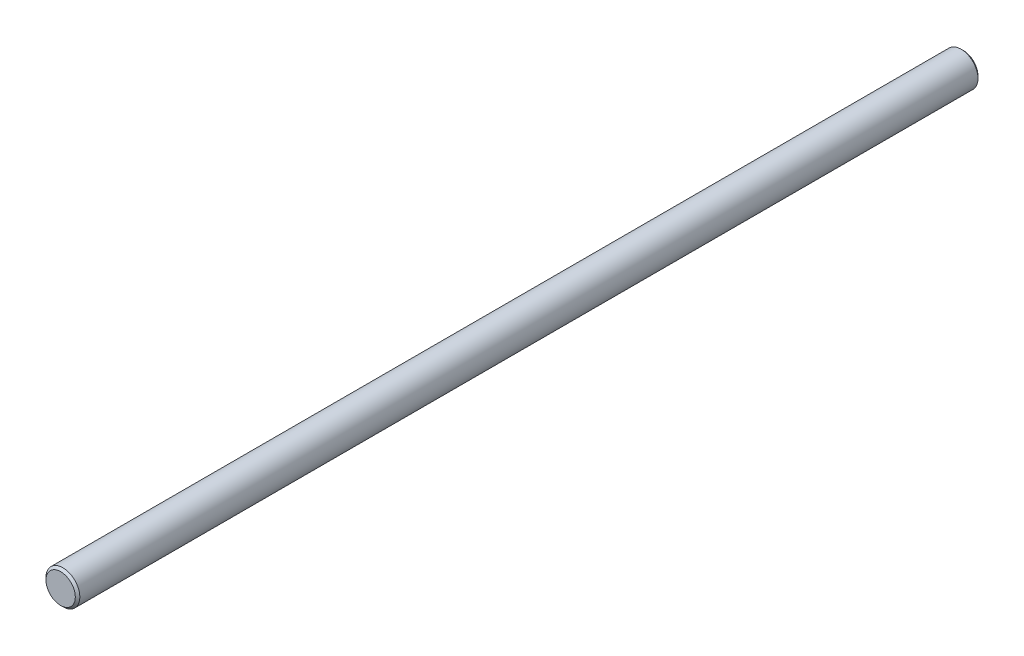
ISO-10303-21;
HEADER;
FILE_DESCRIPTION(('STEP AP214'),'2;1');
FILE_NAME('part.step','',(''),(''),'','','');
FILE_SCHEMA(('AUTOMOTIVE_DESIGN { 1 0 10303 214 1 1 1 1 }'));
ENDSEC;
DATA;
#1=APPLICATION_CONTEXT('core data for automotive mechanical design processes');
#2=APPLICATION_PROTOCOL_DEFINITION('international standard','automotive_design',2000,#1);
#3=PRODUCT_CONTEXT('',#1,'mechanical');
#4=PRODUCT('Part','Part','',(#3));
#5=PRODUCT_RELATED_PRODUCT_CATEGORY('part','',(#4));
#6=PRODUCT_DEFINITION_FORMATION('','',#4);
#7=PRODUCT_DEFINITION_CONTEXT('part definition',#1,'design');
#8=PRODUCT_DEFINITION('design','',#6,#7);
#9=PRODUCT_DEFINITION_SHAPE('','',#8);
#10=(LENGTH_UNIT() NAMED_UNIT(*) SI_UNIT(.MILLI.,.METRE.));
#11=(NAMED_UNIT(*) PLANE_ANGLE_UNIT() SI_UNIT($,.RADIAN.));
#12=(NAMED_UNIT(*) SI_UNIT($,.STERADIAN.) SOLID_ANGLE_UNIT());
#13=UNCERTAINTY_MEASURE_WITH_UNIT(LENGTH_MEASURE(1.E-05),#10,'distance_accuracy_value','');
#14=(GEOMETRIC_REPRESENTATION_CONTEXT(3) GLOBAL_UNCERTAINTY_ASSIGNED_CONTEXT((#13)) GLOBAL_UNIT_ASSIGNED_CONTEXT((#10,
#11,#12)) REPRESENTATION_CONTEXT('',''));
#15=CARTESIAN_POINT('',(0.,0.,0.));
#16=DIRECTION('',(0.,0.,1.));
#17=DIRECTION('',(1.,0.,0.));
#18=AXIS2_PLACEMENT_3D('',#15,#16,#17);
#19=CARTESIAN_POINT('',(0.,0.,254.));
#20=DIRECTION('',(0.,0.,-1.));
#21=DIRECTION('',(-1.,0.,0.));
#22=AXIS2_PLACEMENT_3D('',#19,#20,#21);
#23=CYLINDRICAL_SURFACE('',#22,4.7625);
#24=CARTESIAN_POINT('',(0.,0.,253.365));
#25=DIRECTION('',(0.,0.,1.));
#26=DIRECTION('',(1.,0.,0.));
#27=AXIS2_PLACEMENT_3D('',#24,#25,#26);
#28=CIRCLE('',#27,4.7625);
#29=CARTESIAN_POINT('',(4.7625,0.,253.365));
#30=VERTEX_POINT('',#29);
#31=EDGE_CURVE('E36',#30,#30,#28,.F.);
#32=ORIENTED_EDGE('',*,*,#31,.T.);
#33=EDGE_LOOP('',(#32));
#34=FACE_BOUND('',#33,.T.);
#35=CARTESIAN_POINT('',(0.,0.,0.634999999999997));
#36=DIRECTION('',(0.,0.,1.));
#37=DIRECTION('',(1.,0.,0.));
#38=AXIS2_PLACEMENT_3D('',#35,#36,#37);
#39=CIRCLE('',#38,4.7625);
#40=CARTESIAN_POINT('',(4.7625,0.,0.634999999999997));
#41=VERTEX_POINT('',#40);
#42=EDGE_CURVE('E40',#41,#41,#39,.T.);
#43=ORIENTED_EDGE('',*,*,#42,.T.);
#44=EDGE_LOOP('',(#43));
#45=FACE_BOUND('',#44,.T.);
#46=ADVANCED_FACE('F29',(#34,#45),#23,.T.);
#47=CARTESIAN_POINT('',(0.,0.,254.));
#48=DIRECTION('',(0.,0.,1.));
#49=DIRECTION('',(1.,0.,0.));
#50=AXIS2_PLACEMENT_3D('',#47,#48,#49);
#51=PLANE('',#50);
#52=CARTESIAN_POINT('',(0.,0.,254.));
#53=DIRECTION('',(0.,0.,1.));
#54=DIRECTION('',(1.,0.,0.));
#55=AXIS2_PLACEMENT_3D('',#52,#53,#54);
#56=CIRCLE('',#55,4.12750000000001);
#57=CARTESIAN_POINT('',(4.12750000000001,0.,254.));
#58=VERTEX_POINT('',#57);
#59=EDGE_CURVE('E44',#58,#58,#56,.T.);
#60=ORIENTED_EDGE('',*,*,#59,.T.);
#61=EDGE_LOOP('',(#60));
#62=FACE_BOUND('',#61,.T.);
#63=ADVANCED_FACE('F50',(#62),#51,.T.);
#64=CARTESIAN_POINT('',(0.,0.,0.));
#65=DIRECTION('',(0.,0.,1.));
#66=DIRECTION('',(1.,0.,0.));
#67=AXIS2_PLACEMENT_3D('',#64,#65,#66);
#68=PLANE('',#67);
#69=CARTESIAN_POINT('',(0.,0.,0.));
#70=DIRECTION('',(0.,0.,1.));
#71=DIRECTION('',(1.,0.,0.));
#72=AXIS2_PLACEMENT_3D('',#69,#70,#71);
#73=CIRCLE('',#72,4.12749999999998);
#74=CARTESIAN_POINT('',(4.12749999999998,0.,0.));
#75=VERTEX_POINT('',#74);
#76=EDGE_CURVE('E10',#75,#75,#73,.F.);
#77=ORIENTED_EDGE('',*,*,#76,.T.);
#78=EDGE_LOOP('',(#77));
#79=FACE_BOUND('',#78,.T.);
#80=ADVANCED_FACE('F54',(#79),#68,.F.);
#81=CARTESIAN_POINT('',(0.,0.,254.));
#82=DIRECTION('',(0.,0.,-1.));
#83=DIRECTION('',(-1.,0.,0.));
#84=AXIS2_PLACEMENT_3D('',#81,#82,#83);
#85=CONICAL_SURFACE('',#84,4.12750000000001,0.78539816339749);
#86=ORIENTED_EDGE('',*,*,#31,.F.);
#87=EDGE_LOOP('',(#86));
#88=FACE_BOUND('',#87,.T.);
#89=ORIENTED_EDGE('',*,*,#59,.F.);
#90=EDGE_LOOP('',(#89));
#91=FACE_BOUND('',#90,.T.);
#92=ADVANCED_FACE('F52',(#88,#91),#85,.T.);
#93=CARTESIAN_POINT('',(0.,0.,0.634999999999997));
#94=DIRECTION('',(0.,0.,1.));
#95=DIRECTION('',(1.,0.,0.));
#96=AXIS2_PLACEMENT_3D('',#93,#94,#95);
#97=CONICAL_SURFACE('',#96,4.7625,0.785398163397468);
#98=ORIENTED_EDGE('',*,*,#76,.F.);
#99=EDGE_LOOP('',(#98));
#100=FACE_BOUND('',#99,.T.);
#101=ORIENTED_EDGE('',*,*,#42,.F.);
#102=EDGE_LOOP('',(#101));
#103=FACE_BOUND('',#102,.T.);
#104=ADVANCED_FACE('F31',(#100,#103),#97,.T.);
#105=CLOSED_SHELL('',(#46,#63,#80,#92,#104));
#106=MANIFOLD_SOLID_BREP('B2',#105);
#107=ADVANCED_BREP_SHAPE_REPRESENTATION('',(#18,#106),#14);
#108=SHAPE_DEFINITION_REPRESENTATION(#9,#107);
ENDSEC;
END-ISO-10303-21;
